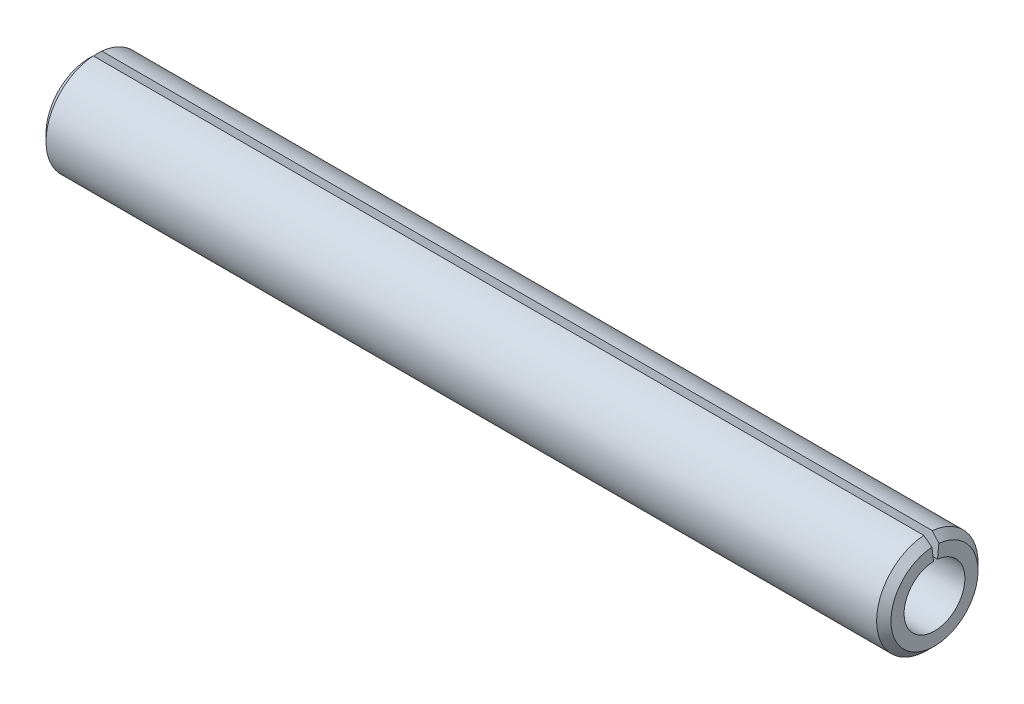
ISO-10303-21;
HEADER;
FILE_DESCRIPTION(('STEP AP214'),'2;1');
FILE_NAME('part.step','',(''),(''),'','','');
FILE_SCHEMA(('AUTOMOTIVE_DESIGN { 1 0 10303 214 1 1 1 1 }'));
ENDSEC;
DATA;
#1=APPLICATION_CONTEXT('core data for automotive mechanical design processes');
#2=APPLICATION_PROTOCOL_DEFINITION('international standard','automotive_design',2000,#1);
#3=PRODUCT_CONTEXT('',#1,'mechanical');
#4=PRODUCT('Part','Part','',(#3));
#5=PRODUCT_RELATED_PRODUCT_CATEGORY('part','',(#4));
#6=PRODUCT_DEFINITION_FORMATION('','',#4);
#7=PRODUCT_DEFINITION_CONTEXT('part definition',#1,'design');
#8=PRODUCT_DEFINITION('design','',#6,#7);
#9=PRODUCT_DEFINITION_SHAPE('','',#8);
#10=(LENGTH_UNIT() NAMED_UNIT(*) SI_UNIT(.MILLI.,.METRE.));
#11=(NAMED_UNIT(*) PLANE_ANGLE_UNIT() SI_UNIT($,.RADIAN.));
#12=(NAMED_UNIT(*) SI_UNIT($,.STERADIAN.) SOLID_ANGLE_UNIT());
#13=UNCERTAINTY_MEASURE_WITH_UNIT(LENGTH_MEASURE(1.E-05),#10,'distance_accuracy_value','');
#14=(GEOMETRIC_REPRESENTATION_CONTEXT(3) GLOBAL_UNCERTAINTY_ASSIGNED_CONTEXT((#13)) GLOBAL_UNIT_ASSIGNED_CONTEXT((#10,
#11,#12)) REPRESENTATION_CONTEXT('',''));
#15=CARTESIAN_POINT('',(0.,0.,0.));
#16=DIRECTION('',(0.,0.,1.));
#17=DIRECTION('',(1.,0.,0.));
#18=AXIS2_PLACEMENT_3D('',#15,#16,#17);
#19=CARTESIAN_POINT('',(25.,0.,-1.09393398282202));
#20=DIRECTION('',(1.,0.,0.));
#21=DIRECTION('',(0.,0.,-1.));
#22=AXIS2_PLACEMENT_3D('',#19,#20,#21);
#23=PLANE('',#22);
#24=DIRECTION('',(0.,0.991473638831733,0.130307419212271));
#25=VECTOR('',#24,1.);
#26=CARTESIAN_POINT('',(25.,0.899626431642924,0.0259284301379491));
#27=LINE('',#26,#25);
#28=CARTESIAN_POINT('',(25.,0.899626431642925,0.0259284301379491));
#29=VERTEX_POINT('',#28);
#30=CARTESIAN_POINT('',(24.9999999999886,1.28558470590642,0.0766541626971721));
#31=VERTEX_POINT('',#30);
#32=EDGE_CURVE('E61',#29,#31,#27,.T.);
#33=ORIENTED_EDGE('',*,*,#32,.T.);
#34=CARTESIAN_POINT('',(24.9999999999773,0.,0.));
#35=DIRECTION('',(-1.,0.,0.));
#36=DIRECTION('',(0.,0.,1.));
#37=AXIS2_PLACEMENT_3D('',#34,#35,#36);
#38=CIRCLE('',#37,1.28786796557279);
#39=CARTESIAN_POINT('',(24.9999999999687,1.28141244643394,-0.128786796559763));
#40=VERTEX_POINT('',#39);
#41=EDGE_CURVE('E84',#40,#31,#38,.T.);
#42=ORIENTED_EDGE('',*,*,#41,.F.);
#43=DIRECTION('',(0.,0.99498743710662,-0.1));
#44=VECTOR('',#43,1.);
#45=CARTESIAN_POINT('',(25.,2.98496231131986,-0.3));
#46=LINE('',#45,#44);
#47=CARTESIAN_POINT('',(25.,0.895488693395958,-0.09));
#48=VERTEX_POINT('',#47);
#49=EDGE_CURVE('E73',#40,#48,#46,.F.);
#50=ORIENTED_EDGE('',*,*,#49,.T.);
#51=CARTESIAN_POINT('',(25.,0.,0.));
#52=DIRECTION('',(-1.,0.,0.));
#53=DIRECTION('',(0.,0.,1.));
#54=AXIS2_PLACEMENT_3D('',#51,#52,#53);
#55=CIRCLE('',#54,0.9);
#56=EDGE_CURVE('E19',#29,#48,#55,.F.);
#57=ORIENTED_EDGE('',*,*,#56,.F.);
#58=EDGE_LOOP('',(#33,#42,#50,#57));
#59=FACE_BOUND('',#58,.T.);
#60=ADVANCED_FACE('F16',(#59),#23,.T.);
#61=CARTESIAN_POINT('',(25.,0.,0.));
#62=DIRECTION('',(-1.,0.,0.));
#63=DIRECTION('',(0.,0.,1.));
#64=AXIS2_PLACEMENT_3D('',#61,#62,#63);
#65=CYLINDRICAL_SURFACE('',#64,0.9);
#66=DIRECTION('',(1.,0.,0.));
#67=VECTOR('',#66,1.);
#68=CARTESIAN_POINT('',(0.,0.899626431642924,0.025928430137949));
#69=LINE('',#68,#67);
#70=CARTESIAN_POINT('',(0.,0.899626431642924,0.025928430137949));
#71=VERTEX_POINT('',#70);
#72=EDGE_CURVE('E65',#71,#29,#69,.T.);
#73=ORIENTED_EDGE('',*,*,#72,.T.);
#74=ORIENTED_EDGE('',*,*,#56,.T.);
#75=DIRECTION('',(1.,0.,0.));
#76=VECTOR('',#75,1.);
#77=CARTESIAN_POINT('',(0.,0.895488693395958,-0.09));
#78=LINE('',#77,#76);
#79=CARTESIAN_POINT('',(0.,0.895488693395958,-0.09));
#80=VERTEX_POINT('',#79);
#81=EDGE_CURVE('E97',#48,#80,#78,.F.);
#82=ORIENTED_EDGE('',*,*,#81,.T.);
#83=CARTESIAN_POINT('',(0.,0.,0.));
#84=DIRECTION('',(-1.,0.,0.));
#85=DIRECTION('',(0.,0.,1.));
#86=AXIS2_PLACEMENT_3D('',#83,#84,#85);
#87=CIRCLE('',#86,0.9);
#88=EDGE_CURVE('E76',#71,#80,#87,.F.);
#89=ORIENTED_EDGE('',*,*,#88,.F.);
#90=EDGE_LOOP('',(#73,#74,#82,#89));
#91=FACE_BOUND('',#90,.T.);
#92=ADVANCED_FACE('F77',(#91),#65,.F.);
#93=CARTESIAN_POINT('',(0.,0.,-1.09393398282202));
#94=DIRECTION('',(-1.,0.,0.));
#95=DIRECTION('',(0.,0.,1.));
#96=AXIS2_PLACEMENT_3D('',#93,#94,#95);
#97=PLANE('',#96);
#98=DIRECTION('',(0.,-0.991473638831733,-0.130307419212271));
#99=VECTOR('',#98,1.);
#100=CARTESIAN_POINT('',(0.,0.397994974842648,-0.04));
#101=LINE('',#100,#99);
#102=CARTESIAN_POINT('',(0.,1.28558470597422,0.0766541627060833));
#103=VERTEX_POINT('',#102);
#104=EDGE_CURVE('E80',#103,#71,#101,.T.);
#105=ORIENTED_EDGE('',*,*,#104,.T.);
#106=ORIENTED_EDGE('',*,*,#88,.T.);
#107=DIRECTION('',(0.,0.99498743710662,-0.1));
#108=VECTOR('',#107,1.);
#109=CARTESIAN_POINT('',(0.,2.98496231131986,-0.3));
#110=LINE('',#109,#108);
#111=CARTESIAN_POINT('',(2.8421709430404E-11,1.28141244653299,-0.128786796571842));
#112=VERTEX_POINT('',#111);
#113=EDGE_CURVE('E93',#80,#112,#110,.T.);
#114=ORIENTED_EDGE('',*,*,#113,.T.);
#115=CARTESIAN_POINT('',(0.,0.,0.));
#116=DIRECTION('',(1.,0.,0.));
#117=DIRECTION('',(0.,1.,0.));
#118=AXIS2_PLACEMENT_3D('',#115,#116,#117);
#119=CIRCLE('',#118,1.28786796562963);
#120=EDGE_CURVE('E99',#103,#112,#119,.T.);
#121=ORIENTED_EDGE('',*,*,#120,.F.);
#122=EDGE_LOOP('',(#105,#106,#114,#121));
#123=FACE_BOUND('',#122,.T.);
#124=ADVANCED_FACE('F151',(#123),#97,.T.);
#125=CARTESIAN_POINT('',(0.,2.98496231131986,-0.3));
#126=DIRECTION('',(0.,-0.1,-0.99498743710662));
#127=DIRECTION('',(0.,0.99498743710662,-0.1));
#128=AXIS2_PLACEMENT_3D('',#125,#126,#127);
#129=PLANE('',#128);
#130=ORIENTED_EDGE('',*,*,#113,.F.);
#131=ORIENTED_EDGE('',*,*,#81,.F.);
#132=ORIENTED_EDGE('',*,*,#49,.F.);
#133=DIRECTION('',(0.707106781186548,-0.703562363973514,0.0707106781186548));
#134=VECTOR('',#133,1.);
#135=CARTESIAN_POINT('',(-498973.712132035,496498.731116203,-49900.));
#136=LINE('',#135,#134);
#137=CARTESIAN_POINT('',(24.7878679656197,1.49248115565701,-0.149999999999189));
#138=VERTEX_POINT('',#137);
#139=EDGE_CURVE('E90',#138,#40,#136,.T.);
#140=ORIENTED_EDGE('',*,*,#139,.F.);
#141=DIRECTION('',(-1.,0.,0.));
#142=VECTOR('',#141,1.);
#143=CARTESIAN_POINT('',(12.5,1.49248115565993,-0.15));
#144=LINE('',#143,#142);
#145=CARTESIAN_POINT('',(0.212132034345432,1.49248115565547,-0.150000000003215));
#146=VERTEX_POINT('',#145);
#147=EDGE_CURVE('E102',#146,#138,#144,.F.);
#148=ORIENTED_EDGE('',*,*,#147,.F.);
#149=DIRECTION('',(-0.707106781186546,-0.703562363973516,0.0707106781186549));
#150=VECTOR('',#149,1.);
#151=CARTESIAN_POINT('',(498998.712132033,496498.731116203,-49900.));
#152=LINE('',#151,#150);
#153=EDGE_CURVE('E82',#112,#146,#152,.F.);
#154=ORIENTED_EDGE('',*,*,#153,.F.);
#155=EDGE_LOOP('',(#130,#131,#132,#140,#148,#154));
#156=FACE_BOUND('',#155,.T.);
#157=ADVANCED_FACE('F144',(#156),#129,.F.);
#158=CARTESIAN_POINT('',(24.7878679655855,0.,0.));
#159=DIRECTION('',(-1.,0.,0.));
#160=DIRECTION('',(0.,0.,1.));
#161=AXIS2_PLACEMENT_3D('',#158,#159,#160);
#162=CONICAL_SURFACE('',#161,1.49999999996453,0.785398163397448);
#163=CARTESIAN_POINT('',(24.9999999999626,1.28558470593233,0.0766541627005777));
#164=CARTESIAN_POINT('',(24.9646505313858,1.32072064482383,0.0812720096500402));
#165=CARTESIAN_POINT('',(24.9292981275572,1.35585367980667,0.0858894749445309));
#166=CARTESIAN_POINT('',(24.8585874494331,1.42611394191833,0.0951236422187471));
#167=CARTESIAN_POINT('',(24.8232291751377,1.46124116904716,0.0997403441984732));
#168=CARTESIAN_POINT('',(24.7878679655904,1.49636549226733,0.104356664523228));
#169=B_SPLINE_CURVE_WITH_KNOTS('',3,(#163,#164,#165,#166,#167,#168),.UNSPECIFIED.,.F.,.F.,(4,2,
4),(0.,0.150163218878054,0.300326437599284),.UNSPECIFIED.);
#170=CARTESIAN_POINT('',(24.7878679656172,1.49636549228738,0.104356664525864));
#171=VERTEX_POINT('',#170);
#172=EDGE_CURVE('E66',#31,#171,#169,.T.);
#173=ORIENTED_EDGE('',*,*,#172,.T.);
#174=CARTESIAN_POINT('',(24.787867965644,0.,0.));
#175=DIRECTION('',(-1.,0.,0.));
#176=DIRECTION('',(0.,0.,1.));
#177=AXIS2_PLACEMENT_3D('',#174,#175,#176);
#178=CIRCLE('',#177,1.5);
#179=EDGE_CURVE('E129',#138,#171,#178,.T.);
#180=ORIENTED_EDGE('',*,*,#179,.F.);
#181=ORIENTED_EDGE('',*,*,#139,.T.);
#182=ORIENTED_EDGE('',*,*,#41,.T.);
#183=EDGE_LOOP('',(#173,#180,#181,#182));
#184=FACE_BOUND('',#183,.T.);
#185=ADVANCED_FACE('F153',(#184),#162,.T.);
#186=CARTESIAN_POINT('',(0.,0.397994974842648,-0.04));
#187=DIRECTION('',(0.,-0.130307419212271,0.991473638831733));
#188=DIRECTION('',(0.,-0.991473638831733,-0.130307419212271));
#189=AXIS2_PLACEMENT_3D('',#186,#187,#188);
#190=PLANE('',#189);
#191=DIRECTION('',(-1.,0.,0.));
#192=VECTOR('',#191,1.);
#193=CARTESIAN_POINT('',(12.5,1.49636549230744,0.104356664528501));
#194=LINE('',#193,#192);
#195=CARTESIAN_POINT('',(0.21213203435219,1.49636549229654,0.104356664527067));
#196=VERTEX_POINT('',#195);
#197=EDGE_CURVE('E25',#171,#196,#194,.T.);
#198=ORIENTED_EDGE('',*,*,#197,.F.);
#199=ORIENTED_EDGE('',*,*,#172,.F.);
#200=ORIENTED_EDGE('',*,*,#32,.F.);
#201=ORIENTED_EDGE('',*,*,#72,.F.);
#202=ORIENTED_EDGE('',*,*,#104,.F.);
#203=CARTESIAN_POINT('',(0.212132034348416,1.49636549228563,0.104356664525634));
#204=CARTESIAN_POINT('',(0.17677082480558,1.46124116906987,0.0997403442014589));
#205=CARTESIAN_POINT('',(0.141412550514599,1.42611394194546,0.0951236422223126));
#206=CARTESIAN_POINT('',(0.0707018723994238,1.35585367984263,0.0858894749492564));
#207=CARTESIAN_POINT('',(0.035349468575236,1.3207206448642,0.0812720096553458));
#208=CARTESIAN_POINT('',(2.91029543549281E-12,1.28558470597712,0.0766541627064635));
#209=B_SPLINE_CURVE_WITH_KNOTS('',3,(#203,#204,#205,#206,#207,#208),.UNSPECIFIED.,.F.,.F.,(4,2,
4),(0.,0.150163218702372,0.300326437561574),.UNSPECIFIED.);
#210=EDGE_CURVE('E34',#196,#103,#209,.T.);
#211=ORIENTED_EDGE('',*,*,#210,.F.);
#212=EDGE_LOOP('',(#198,#199,#200,#201,#202,#211));
#213=FACE_BOUND('',#212,.T.);
#214=ADVANCED_FACE('F63',(#213),#190,.F.);
#215=CARTESIAN_POINT('',(0.2121320343349,0.,0.));
#216=DIRECTION('',(1.,0.,0.));
#217=DIRECTION('',(0.,1.,0.));
#218=AXIS2_PLACEMENT_3D('',#215,#216,#217);
#219=CONICAL_SURFACE('',#218,1.49999999996453,0.785398163397448);
#220=ORIENTED_EDGE('',*,*,#210,.T.);
#221=ORIENTED_EDGE('',*,*,#120,.T.);
#222=ORIENTED_EDGE('',*,*,#153,.T.);
#223=CARTESIAN_POINT('',(0.212132034355965,0.,0.));
#224=DIRECTION('',(-1.,0.,0.));
#225=DIRECTION('',(0.,0.,1.));
#226=AXIS2_PLACEMENT_3D('',#223,#224,#225);
#227=CIRCLE('',#226,1.5);
#228=EDGE_CURVE('E10',#196,#146,#227,.F.);
#229=ORIENTED_EDGE('',*,*,#228,.F.);
#230=EDGE_LOOP('',(#220,#221,#222,#229));
#231=FACE_BOUND('',#230,.T.);
#232=ADVANCED_FACE('F114',(#231),#219,.T.);
#233=CARTESIAN_POINT('',(12.5,0.,0.));
#234=DIRECTION('',(-1.,0.,0.));
#235=DIRECTION('',(0.,0.,1.));
#236=AXIS2_PLACEMENT_3D('',#233,#234,#235);
#237=CYLINDRICAL_SURFACE('',#236,1.5);
#238=ORIENTED_EDGE('',*,*,#197,.T.);
#239=ORIENTED_EDGE('',*,*,#228,.T.);
#240=ORIENTED_EDGE('',*,*,#147,.T.);
#241=ORIENTED_EDGE('',*,*,#179,.T.);
#242=EDGE_LOOP('',(#238,#239,#240,#241));
#243=FACE_BOUND('',#242,.T.);
#244=ADVANCED_FACE('F118',(#243),#237,.T.);
#245=CLOSED_SHELL('',(#60,#92,#124,#157,#185,#214,#232,#244));
#246=MANIFOLD_SOLID_BREP('B1',#245);
#247=ADVANCED_BREP_SHAPE_REPRESENTATION('',(#18,#246),#14);
#248=SHAPE_DEFINITION_REPRESENTATION(#9,#247);
ENDSEC;
END-ISO-10303-21;
